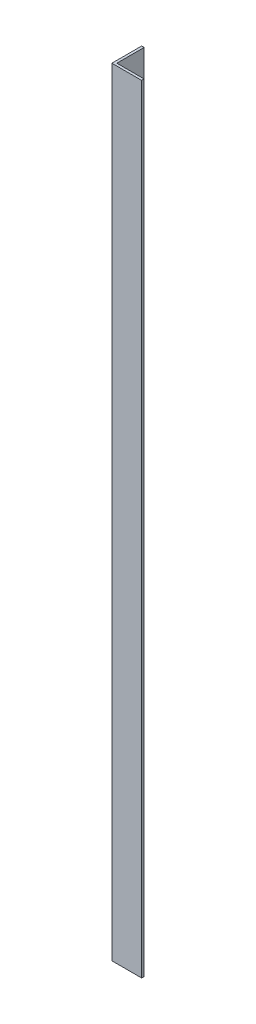
ISO-10303-21;
HEADER;
FILE_DESCRIPTION(('STEP AP214'),'2;1');
FILE_NAME('part.step','',(''),(''),'','','');
FILE_SCHEMA(('AUTOMOTIVE_DESIGN { 1 0 10303 214 1 1 1 1 }'));
ENDSEC;
DATA;
#1=APPLICATION_CONTEXT('core data for automotive mechanical design processes');
#2=APPLICATION_PROTOCOL_DEFINITION('international standard','automotive_design',2000,#1);
#3=PRODUCT_CONTEXT('',#1,'mechanical');
#4=PRODUCT('Part','Part','',(#3));
#5=PRODUCT_RELATED_PRODUCT_CATEGORY('part','',(#4));
#6=PRODUCT_DEFINITION_FORMATION('','',#4);
#7=PRODUCT_DEFINITION_CONTEXT('part definition',#1,'design');
#8=PRODUCT_DEFINITION('design','',#6,#7);
#9=PRODUCT_DEFINITION_SHAPE('','',#8);
#10=(LENGTH_UNIT() NAMED_UNIT(*) SI_UNIT(.MILLI.,.METRE.));
#11=(NAMED_UNIT(*) PLANE_ANGLE_UNIT() SI_UNIT($,.RADIAN.));
#12=(NAMED_UNIT(*) SI_UNIT($,.STERADIAN.) SOLID_ANGLE_UNIT());
#13=UNCERTAINTY_MEASURE_WITH_UNIT(LENGTH_MEASURE(1.E-05),#10,'distance_accuracy_value','');
#14=(GEOMETRIC_REPRESENTATION_CONTEXT(3) GLOBAL_UNCERTAINTY_ASSIGNED_CONTEXT((#13)) GLOBAL_UNIT_ASSIGNED_CONTEXT((#10,
#11,#12)) REPRESENTATION_CONTEXT('',''));
#15=CARTESIAN_POINT('',(0.,0.,0.));
#16=DIRECTION('',(0.,0.,1.));
#17=DIRECTION('',(1.,0.,0.));
#18=AXIS2_PLACEMENT_3D('',#15,#16,#17);
#19=CARTESIAN_POINT('',(19.15,500.,0.));
#20=DIRECTION('',(0.,0.,-1.));
#21=DIRECTION('',(-1.,0.,0.));
#22=AXIS2_PLACEMENT_3D('',#19,#20,#21);
#23=PLANE('',#22);
#24=DIRECTION('',(1.,0.,0.));
#25=VECTOR('',#24,1.);
#26=CARTESIAN_POINT('',(19.15,0.,0.));
#27=LINE('',#26,#25);
#28=CARTESIAN_POINT('',(0.,0.,0.));
#29=VERTEX_POINT('',#28);
#30=CARTESIAN_POINT('',(19.15,0.,0.));
#31=VERTEX_POINT('',#30);
#32=EDGE_CURVE('E117',#29,#31,#27,.T.);
#33=ORIENTED_EDGE('',*,*,#32,.T.);
#34=DIRECTION('',(0.,-1.,0.));
#35=VECTOR('',#34,1.);
#36=CARTESIAN_POINT('',(19.15,500.,0.));
#37=LINE('',#36,#35);
#38=CARTESIAN_POINT('',(19.15,500.,0.));
#39=VERTEX_POINT('',#38);
#40=EDGE_CURVE('E11',#39,#31,#37,.T.);
#41=ORIENTED_EDGE('',*,*,#40,.F.);
#42=DIRECTION('',(1.,0.,0.));
#43=VECTOR('',#42,1.);
#44=CARTESIAN_POINT('',(19.15,500.,0.));
#45=LINE('',#44,#43);
#46=CARTESIAN_POINT('',(0.,500.,0.));
#47=VERTEX_POINT('',#46);
#48=EDGE_CURVE('E127',#47,#39,#45,.T.);
#49=ORIENTED_EDGE('',*,*,#48,.F.);
#50=DIRECTION('',(0.,-1.,0.));
#51=VECTOR('',#50,1.);
#52=CARTESIAN_POINT('',(0.,500.,0.));
#53=LINE('',#52,#51);
#54=EDGE_CURVE('E113',#47,#29,#53,.T.);
#55=ORIENTED_EDGE('',*,*,#54,.T.);
#56=EDGE_LOOP('',(#33,#41,#49,#55));
#57=FACE_BOUND('',#56,.T.);
#58=ADVANCED_FACE('F33',(#57),#23,.F.);
#59=CARTESIAN_POINT('',(19.15,500.,-1.6));
#60=DIRECTION('',(-1.,0.,0.));
#61=DIRECTION('',(0.,0.,1.));
#62=AXIS2_PLACEMENT_3D('',#59,#60,#61);
#63=PLANE('',#62);
#64=DIRECTION('',(0.,0.,-1.));
#65=VECTOR('',#64,1.);
#66=CARTESIAN_POINT('',(19.15,0.,-1.6));
#67=LINE('',#66,#65);
#68=CARTESIAN_POINT('',(19.15,0.,-1.6));
#69=VERTEX_POINT('',#68);
#70=EDGE_CURVE('E120',#31,#69,#67,.T.);
#71=ORIENTED_EDGE('',*,*,#70,.T.);
#72=DIRECTION('',(0.,-1.,0.));
#73=VECTOR('',#72,1.);
#74=CARTESIAN_POINT('',(19.15,500.,-1.6));
#75=LINE('',#74,#73);
#76=CARTESIAN_POINT('',(19.15,500.,-1.6));
#77=VERTEX_POINT('',#76);
#78=EDGE_CURVE('E41',#77,#69,#75,.T.);
#79=ORIENTED_EDGE('',*,*,#78,.F.);
#80=DIRECTION('',(0.,0.,-1.));
#81=VECTOR('',#80,1.);
#82=CARTESIAN_POINT('',(19.15,500.,-1.6));
#83=LINE('',#82,#81);
#84=EDGE_CURVE('E86',#39,#77,#83,.T.);
#85=ORIENTED_EDGE('',*,*,#84,.F.);
#86=ORIENTED_EDGE('',*,*,#40,.T.);
#87=EDGE_LOOP('',(#71,#79,#85,#86));
#88=FACE_BOUND('',#87,.T.);
#89=ADVANCED_FACE('F151',(#88),#63,.F.);
#90=CARTESIAN_POINT('',(1.6,500.,-1.6));
#91=DIRECTION('',(0.,0.,1.));
#92=DIRECTION('',(1.,0.,0.));
#93=AXIS2_PLACEMENT_3D('',#90,#91,#92);
#94=PLANE('',#93);
#95=DIRECTION('',(-1.,0.,0.));
#96=VECTOR('',#95,1.);
#97=CARTESIAN_POINT('',(1.6,0.,-1.6));
#98=LINE('',#97,#96);
#99=CARTESIAN_POINT('',(1.6,0.,-1.6));
#100=VERTEX_POINT('',#99);
#101=EDGE_CURVE('E122',#69,#100,#98,.T.);
#102=ORIENTED_EDGE('',*,*,#101,.T.);
#103=DIRECTION('',(0.,-1.,0.));
#104=VECTOR('',#103,1.);
#105=CARTESIAN_POINT('',(1.6,500.,-1.6));
#106=LINE('',#105,#104);
#107=CARTESIAN_POINT('',(1.6,500.,-1.6));
#108=VERTEX_POINT('',#107);
#109=EDGE_CURVE('E108',#108,#100,#106,.T.);
#110=ORIENTED_EDGE('',*,*,#109,.F.);
#111=DIRECTION('',(-1.,0.,0.));
#112=VECTOR('',#111,1.);
#113=CARTESIAN_POINT('',(1.6,500.,-1.6));
#114=LINE('',#113,#112);
#115=EDGE_CURVE('E99',#77,#108,#114,.T.);
#116=ORIENTED_EDGE('',*,*,#115,.F.);
#117=ORIENTED_EDGE('',*,*,#78,.T.);
#118=EDGE_LOOP('',(#102,#110,#116,#117));
#119=FACE_BOUND('',#118,.T.);
#120=ADVANCED_FACE('F133',(#119),#94,.F.);
#121=CARTESIAN_POINT('',(1.6,500.,-19.15));
#122=DIRECTION('',(-1.,0.,0.));
#123=DIRECTION('',(0.,0.,1.));
#124=AXIS2_PLACEMENT_3D('',#121,#122,#123);
#125=PLANE('',#124);
#126=DIRECTION('',(0.,0.,-1.));
#127=VECTOR('',#126,1.);
#128=CARTESIAN_POINT('',(1.6,0.,-19.15));
#129=LINE('',#128,#127);
#130=CARTESIAN_POINT('',(1.6,0.,-19.15));
#131=VERTEX_POINT('',#130);
#132=EDGE_CURVE('E107',#100,#131,#129,.T.);
#133=ORIENTED_EDGE('',*,*,#132,.T.);
#134=DIRECTION('',(0.,-1.,0.));
#135=VECTOR('',#134,1.);
#136=CARTESIAN_POINT('',(1.6,500.,-19.15));
#137=LINE('',#136,#135);
#138=CARTESIAN_POINT('',(1.6,500.,-19.15));
#139=VERTEX_POINT('',#138);
#140=EDGE_CURVE('E104',#139,#131,#137,.T.);
#141=ORIENTED_EDGE('',*,*,#140,.F.);
#142=DIRECTION('',(0.,0.,-1.));
#143=VECTOR('',#142,1.);
#144=CARTESIAN_POINT('',(1.6,500.,-19.15));
#145=LINE('',#144,#143);
#146=EDGE_CURVE('E93',#108,#139,#145,.T.);
#147=ORIENTED_EDGE('',*,*,#146,.F.);
#148=ORIENTED_EDGE('',*,*,#109,.T.);
#149=EDGE_LOOP('',(#133,#141,#147,#148));
#150=FACE_BOUND('',#149,.T.);
#151=ADVANCED_FACE('F105',(#150),#125,.F.);
#152=CARTESIAN_POINT('',(0.,500.,-19.15));
#153=DIRECTION('',(0.,0.,1.));
#154=DIRECTION('',(1.,0.,0.));
#155=AXIS2_PLACEMENT_3D('',#152,#153,#154);
#156=PLANE('',#155);
#157=DIRECTION('',(-1.,0.,0.));
#158=VECTOR('',#157,1.);
#159=CARTESIAN_POINT('',(0.,0.,-19.15));
#160=LINE('',#159,#158);
#161=CARTESIAN_POINT('',(0.,0.,-19.15));
#162=VERTEX_POINT('',#161);
#163=EDGE_CURVE('E72',#131,#162,#160,.T.);
#164=ORIENTED_EDGE('',*,*,#163,.T.);
#165=DIRECTION('',(0.,-1.,0.));
#166=VECTOR('',#165,1.);
#167=CARTESIAN_POINT('',(0.,500.,-19.15));
#168=LINE('',#167,#166);
#169=CARTESIAN_POINT('',(0.,500.,-19.15));
#170=VERTEX_POINT('',#169);
#171=EDGE_CURVE('E109',#170,#162,#168,.T.);
#172=ORIENTED_EDGE('',*,*,#171,.F.);
#173=DIRECTION('',(-1.,0.,0.));
#174=VECTOR('',#173,1.);
#175=CARTESIAN_POINT('',(0.,500.,-19.15));
#176=LINE('',#175,#174);
#177=EDGE_CURVE('E97',#139,#170,#176,.T.);
#178=ORIENTED_EDGE('',*,*,#177,.F.);
#179=ORIENTED_EDGE('',*,*,#140,.T.);
#180=EDGE_LOOP('',(#164,#172,#178,#179));
#181=FACE_BOUND('',#180,.T.);
#182=ADVANCED_FACE('F111',(#181),#156,.F.);
#183=CARTESIAN_POINT('',(0.,500.,0.));
#184=DIRECTION('',(1.,0.,0.));
#185=DIRECTION('',(0.,0.,-1.));
#186=AXIS2_PLACEMENT_3D('',#183,#184,#185);
#187=PLANE('',#186);
#188=DIRECTION('',(0.,0.,1.));
#189=VECTOR('',#188,1.);
#190=CARTESIAN_POINT('',(0.,0.,0.));
#191=LINE('',#190,#189);
#192=EDGE_CURVE('E78',#162,#29,#191,.T.);
#193=ORIENTED_EDGE('',*,*,#192,.T.);
#194=ORIENTED_EDGE('',*,*,#54,.F.);
#195=DIRECTION('',(0.,0.,1.));
#196=VECTOR('',#195,1.);
#197=CARTESIAN_POINT('',(0.,500.,0.));
#198=LINE('',#197,#196);
#199=EDGE_CURVE('E49',#170,#47,#198,.T.);
#200=ORIENTED_EDGE('',*,*,#199,.F.);
#201=ORIENTED_EDGE('',*,*,#171,.T.);
#202=EDGE_LOOP('',(#193,#194,#200,#201));
#203=FACE_BOUND('',#202,.T.);
#204=ADVANCED_FACE('F140',(#203),#187,.F.);
#205=CARTESIAN_POINT('',(0.,500.,0.));
#206=DIRECTION('',(0.,-1.,0.));
#207=DIRECTION('',(0.,0.,-1.));
#208=AXIS2_PLACEMENT_3D('',#205,#206,#207);
#209=PLANE('',#208);
#210=ORIENTED_EDGE('',*,*,#48,.T.);
#211=ORIENTED_EDGE('',*,*,#84,.T.);
#212=ORIENTED_EDGE('',*,*,#115,.T.);
#213=ORIENTED_EDGE('',*,*,#146,.T.);
#214=ORIENTED_EDGE('',*,*,#177,.T.);
#215=ORIENTED_EDGE('',*,*,#199,.T.);
#216=EDGE_LOOP('',(#210,#211,#212,#213,#214,#215));
#217=FACE_BOUND('',#216,.T.);
#218=ADVANCED_FACE('F95',(#217),#209,.F.);
#219=CARTESIAN_POINT('',(0.,0.,0.));
#220=DIRECTION('',(0.,-1.,0.));
#221=DIRECTION('',(0.,0.,-1.));
#222=AXIS2_PLACEMENT_3D('',#219,#220,#221);
#223=PLANE('',#222);
#224=ORIENTED_EDGE('',*,*,#32,.F.);
#225=ORIENTED_EDGE('',*,*,#192,.F.);
#226=ORIENTED_EDGE('',*,*,#163,.F.);
#227=ORIENTED_EDGE('',*,*,#132,.F.);
#228=ORIENTED_EDGE('',*,*,#101,.F.);
#229=ORIENTED_EDGE('',*,*,#70,.F.);
#230=EDGE_LOOP('',(#224,#225,#226,#227,#228,#229));
#231=FACE_BOUND('',#230,.T.);
#232=ADVANCED_FACE('F136',(#231),#223,.T.);
#233=CLOSED_SHELL('',(#58,#89,#120,#151,#182,#204,#218,#232));
#234=MANIFOLD_SOLID_BREP('B2',#233);
#235=ADVANCED_BREP_SHAPE_REPRESENTATION('',(#18,#234),#14);
#236=SHAPE_DEFINITION_REPRESENTATION(#9,#235);
ENDSEC;
END-ISO-10303-21;
